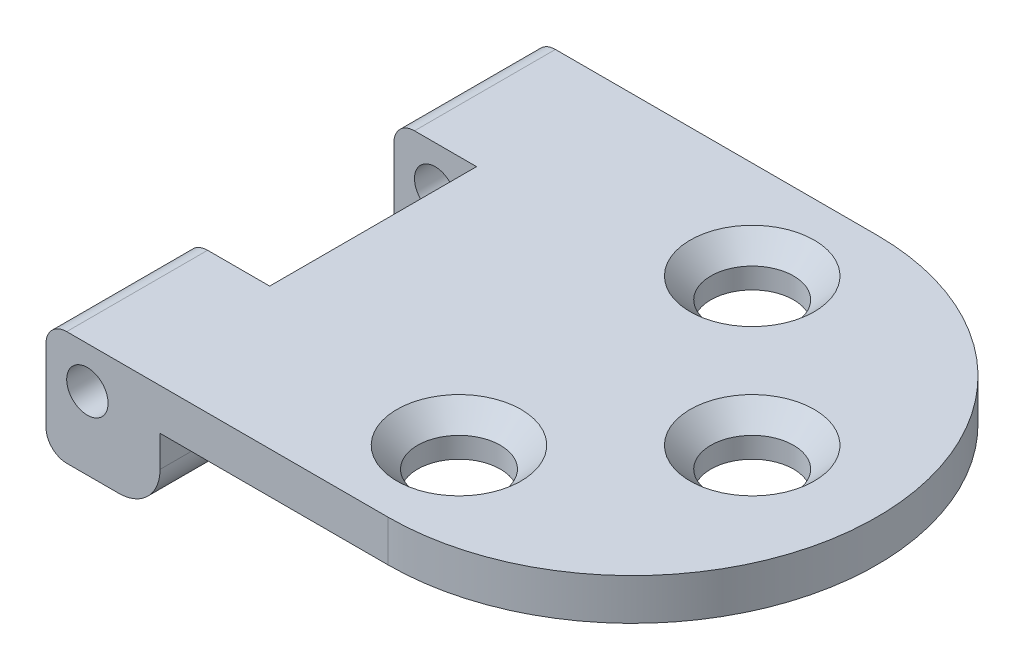
ISO-10303-21;
HEADER;
FILE_DESCRIPTION(('STEP AP214'),'2;1');
FILE_NAME('part.step','',(''),(''),'','','');
FILE_SCHEMA(('AUTOMOTIVE_DESIGN { 1 0 10303 214 1 1 1 1 }'));
ENDSEC;
DATA;
#1=APPLICATION_CONTEXT('core data for automotive mechanical design processes');
#2=APPLICATION_PROTOCOL_DEFINITION('international standard','automotive_design',2000,#1);
#3=PRODUCT_CONTEXT('',#1,'mechanical');
#4=PRODUCT('Part','Part','',(#3));
#5=PRODUCT_RELATED_PRODUCT_CATEGORY('part','',(#4));
#6=PRODUCT_DEFINITION_FORMATION('','',#4);
#7=PRODUCT_DEFINITION_CONTEXT('part definition',#1,'design');
#8=PRODUCT_DEFINITION('design','',#6,#7);
#9=PRODUCT_DEFINITION_SHAPE('','',#8);
#10=(LENGTH_UNIT() NAMED_UNIT(*) SI_UNIT(.MILLI.,.METRE.));
#11=(NAMED_UNIT(*) PLANE_ANGLE_UNIT() SI_UNIT($,.RADIAN.));
#12=(NAMED_UNIT(*) SI_UNIT($,.STERADIAN.) SOLID_ANGLE_UNIT());
#13=UNCERTAINTY_MEASURE_WITH_UNIT(LENGTH_MEASURE(1.E-05),#10,'distance_accuracy_value','');
#14=(GEOMETRIC_REPRESENTATION_CONTEXT(3) GLOBAL_UNCERTAINTY_ASSIGNED_CONTEXT((#13)) GLOBAL_UNIT_ASSIGNED_CONTEXT((#10,
#11,#12)) REPRESENTATION_CONTEXT('',''));
#15=CARTESIAN_POINT('',(0.,0.,0.));
#16=DIRECTION('',(0.,0.,1.));
#17=DIRECTION('',(1.,0.,0.));
#18=AXIS2_PLACEMENT_3D('',#15,#16,#17);
#19=CARTESIAN_POINT('',(0.,7.,0.));
#20=DIRECTION('',(1.,0.,0.));
#21=DIRECTION('',(0.,0.,-1.));
#22=AXIS2_PLACEMENT_3D('',#19,#20,#21);
#23=PLANE('',#22);
#24=DIRECTION('',(0.,0.,1.));
#25=VECTOR('',#24,1.);
#26=CARTESIAN_POINT('',(0.,1.27,0.));
#27=LINE('',#26,#25);
#28=CARTESIAN_POINT('',(0.,1.27,-30.));
#29=VERTEX_POINT('',#28);
#30=CARTESIAN_POINT('',(0.,1.27,-21.35));
#31=VERTEX_POINT('',#30);
#32=EDGE_CURVE('E169',#29,#31,#27,.T.);
#33=ORIENTED_EDGE('',*,*,#32,.T.);
#34=DIRECTION('',(0.,1.,0.));
#35=VECTOR('',#34,1.);
#36=CARTESIAN_POINT('',(0.,-0.00100000000000013,-21.35));
#37=LINE('',#36,#35);
#38=CARTESIAN_POINT('',(0.,5.73,-21.35));
#39=VERTEX_POINT('',#38);
#40=EDGE_CURVE('E153',#31,#39,#37,.T.);
#41=ORIENTED_EDGE('',*,*,#40,.T.);
#42=DIRECTION('',(0.,0.,1.));
#43=VECTOR('',#42,1.);
#44=CARTESIAN_POINT('',(0.,5.73,0.));
#45=LINE('',#44,#43);
#46=CARTESIAN_POINT('',(0.,5.73,-30.));
#47=VERTEX_POINT('',#46);
#48=EDGE_CURVE('E167',#39,#47,#45,.F.);
#49=ORIENTED_EDGE('',*,*,#48,.T.);
#50=DIRECTION('',(0.,-1.,0.));
#51=VECTOR('',#50,1.);
#52=CARTESIAN_POINT('',(0.,7.,-30.));
#53=LINE('',#52,#51);
#54=EDGE_CURVE('E333',#47,#29,#53,.T.);
#55=ORIENTED_EDGE('',*,*,#54,.T.);
#56=EDGE_LOOP('',(#33,#41,#49,#55));
#57=FACE_BOUND('',#56,.T.);
#58=ADVANCED_FACE('F35',(#57),#23,.F.);
#59=CARTESIAN_POINT('',(21.000000028,0.,-15.));
#60=DIRECTION('',(0.,-1.,0.));
#61=DIRECTION('',(0.,0.,-1.));
#62=AXIS2_PLACEMENT_3D('',#59,#60,#61);
#63=PLANE('',#62);
#64=DIRECTION('',(-1.,0.,0.));
#65=VECTOR('',#64,1.);
#66=CARTESIAN_POINT('',(0.,0.,-21.35));
#67=LINE('',#66,#65);
#68=CARTESIAN_POINT('',(4.46,0.,-21.35));
#69=VERTEX_POINT('',#68);
#70=CARTESIAN_POINT('',(1.27,0.,-21.35));
#71=VERTEX_POINT('',#70);
#72=EDGE_CURVE('E283',#69,#71,#67,.T.);
#73=ORIENTED_EDGE('',*,*,#72,.T.);
#74=DIRECTION('',(0.,0.,1.));
#75=VECTOR('',#74,1.);
#76=CARTESIAN_POINT('',(1.27,0.,-30.));
#77=LINE('',#76,#75);
#78=CARTESIAN_POINT('',(1.27,0.,-30.));
#79=VERTEX_POINT('',#78);
#80=EDGE_CURVE('E188',#71,#79,#77,.F.);
#81=ORIENTED_EDGE('',*,*,#80,.T.);
#82=DIRECTION('',(-1.,0.,0.));
#83=VECTOR('',#82,1.);
#84=CARTESIAN_POINT('',(0.,0.,-30.));
#85=LINE('',#84,#83);
#86=CARTESIAN_POINT('',(4.46,0.,-30.));
#87=VERTEX_POINT('',#86);
#88=EDGE_CURVE('E329',#87,#79,#85,.T.);
#89=ORIENTED_EDGE('',*,*,#88,.F.);
#90=DIRECTION('',(0.,0.,-1.));
#91=VECTOR('',#90,1.);
#92=CARTESIAN_POINT('',(4.46,0.,0.));
#93=LINE('',#92,#91);
#94=EDGE_CURVE('E179',#87,#69,#93,.F.);
#95=ORIENTED_EDGE('',*,*,#94,.T.);
#96=EDGE_LOOP('',(#73,#81,#89,#95));
#97=FACE_BOUND('',#96,.T.);
#98=ADVANCED_FACE('F230',(#97),#63,.T.);
#99=CARTESIAN_POINT('',(1.27,1.27,0.));
#100=DIRECTION('',(0.,0.,-1.));
#101=DIRECTION('',(-1.,0.,0.));
#102=AXIS2_PLACEMENT_3D('',#99,#100,#101);
#103=CYLINDRICAL_SURFACE('',#102,1.27);
#104=CARTESIAN_POINT('',(1.27,1.27,-21.35));
#105=DIRECTION('',(0.,0.,-1.));
#106=DIRECTION('',(-1.,0.,0.));
#107=AXIS2_PLACEMENT_3D('',#104,#105,#106);
#108=CIRCLE('',#107,1.27);
#109=EDGE_CURVE('E161',#71,#31,#108,.T.);
#110=ORIENTED_EDGE('',*,*,#109,.T.);
#111=ORIENTED_EDGE('',*,*,#32,.F.);
#112=CARTESIAN_POINT('',(1.27,1.27,-30.));
#113=DIRECTION('',(0.,0.,1.));
#114=DIRECTION('',(1.,0.,0.));
#115=AXIS2_PLACEMENT_3D('',#112,#113,#114);
#116=CIRCLE('',#115,1.27);
#117=EDGE_CURVE('E193',#79,#29,#116,.F.);
#118=ORIENTED_EDGE('',*,*,#117,.F.);
#119=ORIENTED_EDGE('',*,*,#80,.F.);
#120=EDGE_LOOP('',(#110,#111,#118,#119));
#121=FACE_BOUND('',#120,.T.);
#122=ADVANCED_FACE('F236',(#121),#103,.T.);
#123=CARTESIAN_POINT('',(1.27,5.73,-15.));
#124=DIRECTION('',(0.,0.,1.));
#125=DIRECTION('',(1.,0.,0.));
#126=AXIS2_PLACEMENT_3D('',#123,#124,#125);
#127=CYLINDRICAL_SURFACE('',#126,1.27);
#128=CARTESIAN_POINT('',(1.27,5.73,-21.35));
#129=DIRECTION('',(0.,0.,-1.));
#130=DIRECTION('',(-1.,0.,0.));
#131=AXIS2_PLACEMENT_3D('',#128,#129,#130);
#132=CIRCLE('',#131,1.27);
#133=CARTESIAN_POINT('',(1.27,7.,-21.35));
#134=VERTEX_POINT('',#133);
#135=EDGE_CURVE('E150',#39,#134,#132,.T.);
#136=ORIENTED_EDGE('',*,*,#135,.T.);
#137=DIRECTION('',(0.,0.,1.));
#138=VECTOR('',#137,1.);
#139=CARTESIAN_POINT('',(1.27,7.,-15.));
#140=LINE('',#139,#138);
#141=CARTESIAN_POINT('',(1.27,7.,-30.));
#142=VERTEX_POINT('',#141);
#143=EDGE_CURVE('E196',#142,#134,#140,.T.);
#144=ORIENTED_EDGE('',*,*,#143,.F.);
#145=CARTESIAN_POINT('',(1.27,5.73,-30.));
#146=DIRECTION('',(0.,0.,1.));
#147=DIRECTION('',(1.,0.,0.));
#148=AXIS2_PLACEMENT_3D('',#145,#146,#147);
#149=CIRCLE('',#148,1.27);
#150=EDGE_CURVE('E59',#47,#142,#149,.F.);
#151=ORIENTED_EDGE('',*,*,#150,.F.);
#152=ORIENTED_EDGE('',*,*,#48,.F.);
#153=EDGE_LOOP('',(#136,#144,#151,#152));
#154=FACE_BOUND('',#153,.T.);
#155=ADVANCED_FACE('F173',(#154),#127,.T.);
#156=CARTESIAN_POINT('',(21.000000028,7.,-15.));
#157=DIRECTION('',(0.,-1.,0.));
#158=DIRECTION('',(0.,0.,-1.));
#159=AXIS2_PLACEMENT_3D('',#156,#157,#158);
#160=CYLINDRICAL_SURFACE('',#159,15.);
#161=CARTESIAN_POINT('',(21.000000028,4.46,-15.));
#162=DIRECTION('',(0.,-1.,0.));
#163=DIRECTION('',(0.,0.,-1.));
#164=AXIS2_PLACEMENT_3D('',#161,#162,#163);
#165=CIRCLE('',#164,15.);
#166=CARTESIAN_POINT('',(21.000000028,4.46,-30.));
#167=VERTEX_POINT('',#166);
#168=CARTESIAN_POINT('',(21.000000028,4.46,0.));
#169=VERTEX_POINT('',#168);
#170=EDGE_CURVE('E323',#167,#169,#165,.T.);
#171=ORIENTED_EDGE('',*,*,#170,.F.);
#172=DIRECTION('',(0.,-1.,0.));
#173=VECTOR('',#172,1.);
#174=CARTESIAN_POINT('',(21.000000028,7.,-30.));
#175=LINE('',#174,#173);
#176=CARTESIAN_POINT('',(21.000000028,7.,-30.));
#177=VERTEX_POINT('',#176);
#178=EDGE_CURVE('E339',#177,#167,#175,.T.);
#179=ORIENTED_EDGE('',*,*,#178,.F.);
#180=CARTESIAN_POINT('',(21.000000028,7.,-15.));
#181=DIRECTION('',(0.,1.,0.));
#182=DIRECTION('',(0.,0.,-1.));
#183=AXIS2_PLACEMENT_3D('',#180,#181,#182);
#184=CIRCLE('',#183,15.);
#185=CARTESIAN_POINT('',(21.000000028,7.,0.));
#186=VERTEX_POINT('',#185);
#187=EDGE_CURVE('E328',#186,#177,#184,.T.);
#188=ORIENTED_EDGE('',*,*,#187,.F.);
#189=DIRECTION('',(0.,-1.,0.));
#190=VECTOR('',#189,1.);
#191=CARTESIAN_POINT('',(21.000000028,7.,0.));
#192=LINE('',#191,#190);
#193=EDGE_CURVE('E342',#186,#169,#192,.T.);
#194=ORIENTED_EDGE('',*,*,#193,.T.);
#195=EDGE_LOOP('',(#171,#179,#188,#194));
#196=FACE_BOUND('',#195,.T.);
#197=ADVANCED_FACE('F244',(#196),#160,.T.);
#198=CARTESIAN_POINT('',(0.,5.73,0.));
#199=VERTEX_POINT('',#198);
#200=CARTESIAN_POINT('',(0.,5.73,-8.65));
#201=VERTEX_POINT('',#200);
#202=EDGE_CURVE('E174',#199,#201,#45,.F.);
#203=ORIENTED_EDGE('',*,*,#202,.T.);
#204=DIRECTION('',(0.,1.,0.));
#205=VECTOR('',#204,1.);
#206=CARTESIAN_POINT('',(0.,-0.00100000000000013,-8.65));
#207=LINE('',#206,#205);
#208=CARTESIAN_POINT('',(0.,1.27,-8.65));
#209=VERTEX_POINT('',#208);
#210=EDGE_CURVE('E51',#209,#201,#207,.T.);
#211=ORIENTED_EDGE('',*,*,#210,.F.);
#212=CARTESIAN_POINT('',(0.,1.27,0.));
#213=VERTEX_POINT('',#212);
#214=EDGE_CURVE('E178',#209,#213,#27,.T.);
#215=ORIENTED_EDGE('',*,*,#214,.T.);
#216=DIRECTION('',(0.,-1.,0.));
#217=VECTOR('',#216,1.);
#218=CARTESIAN_POINT('',(0.,7.,0.));
#219=LINE('',#218,#217);
#220=EDGE_CURVE('E259',#199,#213,#219,.T.);
#221=ORIENTED_EDGE('',*,*,#220,.F.);
#222=EDGE_LOOP('',(#203,#211,#215,#221));
#223=FACE_BOUND('',#222,.T.);
#224=ADVANCED_FACE('F232',(#223),#23,.F.);
#225=CARTESIAN_POINT('',(0.,7.,0.));
#226=DIRECTION('',(0.,0.,-1.));
#227=DIRECTION('',(-1.,0.,0.));
#228=AXIS2_PLACEMENT_3D('',#225,#226,#227);
#229=PLANE('',#228);
#230=CARTESIAN_POINT('',(2.54,4.46,0.));
#231=DIRECTION('',(0.,0.,1.));
#232=DIRECTION('',(1.,0.,0.));
#233=AXIS2_PLACEMENT_3D('',#230,#231,#232);
#234=CIRCLE('',#233,1.27);
#235=CARTESIAN_POINT('',(3.81,4.46,0.));
#236=VERTEX_POINT('',#235);
#237=EDGE_CURVE('E423',#236,#236,#234,.T.);
#238=ORIENTED_EDGE('',*,*,#237,.F.);
#239=EDGE_LOOP('',(#238));
#240=FACE_BOUND('',#239,.T.);
#241=ORIENTED_EDGE('',*,*,#220,.T.);
#242=CARTESIAN_POINT('',(1.27,1.27,0.));
#243=DIRECTION('',(0.,0.,-1.));
#244=DIRECTION('',(-1.,0.,0.));
#245=AXIS2_PLACEMENT_3D('',#242,#243,#244);
#246=CIRCLE('',#245,1.27);
#247=CARTESIAN_POINT('',(1.27,0.,0.));
#248=VERTEX_POINT('',#247);
#249=EDGE_CURVE('E186',#213,#248,#246,.F.);
#250=ORIENTED_EDGE('',*,*,#249,.T.);
#251=DIRECTION('',(1.,0.,0.));
#252=VECTOR('',#251,1.);
#253=CARTESIAN_POINT('',(0.,0.,0.));
#254=LINE('',#253,#252);
#255=CARTESIAN_POINT('',(4.46,0.,0.));
#256=VERTEX_POINT('',#255);
#257=EDGE_CURVE('E325',#248,#256,#254,.T.);
#258=ORIENTED_EDGE('',*,*,#257,.T.);
#259=CARTESIAN_POINT('',(4.46,2.54,0.));
#260=DIRECTION('',(0.,0.,-1.));
#261=DIRECTION('',(-1.,0.,0.));
#262=AXIS2_PLACEMENT_3D('',#259,#260,#261);
#263=CIRCLE('',#262,2.54);
#264=CARTESIAN_POINT('',(7.,2.54,0.));
#265=VERTEX_POINT('',#264);
#266=EDGE_CURVE('E175',#256,#265,#263,.F.);
#267=ORIENTED_EDGE('',*,*,#266,.T.);
#268=DIRECTION('',(0.,-1.,0.));
#269=VECTOR('',#268,1.);
#270=CARTESIAN_POINT('',(7.,48.8757583149545,0.));
#271=LINE('',#270,#269);
#272=CARTESIAN_POINT('',(7.,4.46,0.));
#273=VERTEX_POINT('',#272);
#274=EDGE_CURVE('E313',#273,#265,#271,.T.);
#275=ORIENTED_EDGE('',*,*,#274,.F.);
#276=DIRECTION('',(-1.,0.,0.));
#277=VECTOR('',#276,1.);
#278=CARTESIAN_POINT('',(7.,4.46,0.));
#279=LINE('',#278,#277);
#280=EDGE_CURVE('E310',#169,#273,#279,.T.);
#281=ORIENTED_EDGE('',*,*,#280,.F.);
#282=ORIENTED_EDGE('',*,*,#193,.F.);
#283=DIRECTION('',(1.,0.,0.));
#284=VECTOR('',#283,1.);
#285=CARTESIAN_POINT('',(0.,7.,0.));
#286=LINE('',#285,#284);
#287=CARTESIAN_POINT('',(1.27,7.,0.));
#288=VERTEX_POINT('',#287);
#289=EDGE_CURVE('E326',#288,#186,#286,.T.);
#290=ORIENTED_EDGE('',*,*,#289,.F.);
#291=CARTESIAN_POINT('',(1.27,5.73,0.));
#292=DIRECTION('',(0.,0.,-1.));
#293=DIRECTION('',(-1.,0.,0.));
#294=AXIS2_PLACEMENT_3D('',#291,#292,#293);
#295=CIRCLE('',#294,1.27);
#296=EDGE_CURVE('E184',#288,#199,#295,.F.);
#297=ORIENTED_EDGE('',*,*,#296,.T.);
#298=EDGE_LOOP('',(#241,#250,#258,#267,#275,#281,#282,#290,#297));
#299=FACE_BOUND('',#298,.T.);
#300=ADVANCED_FACE('F243',(#240,#299),#229,.F.);
#301=CARTESIAN_POINT('',(0.,7.,-30.));
#302=DIRECTION('',(0.,0.,1.));
#303=DIRECTION('',(1.,0.,0.));
#304=AXIS2_PLACEMENT_3D('',#301,#302,#303);
#305=PLANE('',#304);
#306=CARTESIAN_POINT('',(2.54,4.46,-30.));
#307=DIRECTION('',(0.,0.,1.));
#308=DIRECTION('',(1.,0.,0.));
#309=AXIS2_PLACEMENT_3D('',#306,#307,#308);
#310=CIRCLE('',#309,1.27);
#311=CARTESIAN_POINT('',(3.81,4.46,-30.));
#312=VERTEX_POINT('',#311);
#313=EDGE_CURVE('E421',#312,#312,#310,.T.);
#314=ORIENTED_EDGE('',*,*,#313,.T.);
#315=EDGE_LOOP('',(#314));
#316=FACE_BOUND('',#315,.T.);
#317=ORIENTED_EDGE('',*,*,#88,.T.);
#318=ORIENTED_EDGE('',*,*,#117,.T.);
#319=ORIENTED_EDGE('',*,*,#54,.F.);
#320=ORIENTED_EDGE('',*,*,#150,.T.);
#321=DIRECTION('',(-1.,0.,0.));
#322=VECTOR('',#321,1.);
#323=CARTESIAN_POINT('',(0.,7.,-30.));
#324=LINE('',#323,#322);
#325=EDGE_CURVE('E331',#177,#142,#324,.T.);
#326=ORIENTED_EDGE('',*,*,#325,.F.);
#327=ORIENTED_EDGE('',*,*,#178,.T.);
#328=DIRECTION('',(-1.,0.,0.));
#329=VECTOR('',#328,1.);
#330=CARTESIAN_POINT('',(7.,4.46,-30.));
#331=LINE('',#330,#329);
#332=CARTESIAN_POINT('',(7.,4.46,-30.));
#333=VERTEX_POINT('',#332);
#334=EDGE_CURVE('E316',#167,#333,#331,.T.);
#335=ORIENTED_EDGE('',*,*,#334,.T.);
#336=DIRECTION('',(0.,-1.,0.));
#337=VECTOR('',#336,1.);
#338=CARTESIAN_POINT('',(7.,48.8757583149545,-30.));
#339=LINE('',#338,#337);
#340=CARTESIAN_POINT('',(7.,2.54,-30.));
#341=VERTEX_POINT('',#340);
#342=EDGE_CURVE('E303',#333,#341,#339,.T.);
#343=ORIENTED_EDGE('',*,*,#342,.T.);
#344=CARTESIAN_POINT('',(4.46,2.54,-30.));
#345=DIRECTION('',(0.,0.,1.));
#346=DIRECTION('',(1.,0.,0.));
#347=AXIS2_PLACEMENT_3D('',#344,#345,#346);
#348=CIRCLE('',#347,2.54);
#349=EDGE_CURVE('E349',#341,#87,#348,.F.);
#350=ORIENTED_EDGE('',*,*,#349,.T.);
#351=EDGE_LOOP('',(#317,#318,#319,#320,#326,#327,#335,#343,#350));
#352=FACE_BOUND('',#351,.T.);
#353=ADVANCED_FACE('F251',(#316,#352),#305,.F.);
#354=CARTESIAN_POINT('',(21.000000028,7.,-15.));
#355=DIRECTION('',(0.,-1.,0.));
#356=DIRECTION('',(0.,0.,-1.));
#357=AXIS2_PLACEMENT_3D('',#354,#355,#356);
#358=PLANE('',#357);
#359=CARTESIAN_POINT('',(19.3499994,7.,-6.00000022000001));
#360=DIRECTION('',(0.,-1.,0.));
#361=DIRECTION('',(0.,0.,-1.));
#362=AXIS2_PLACEMENT_3D('',#359,#360,#361);
#363=CIRCLE('',#362,3.81000000000001);
#364=CARTESIAN_POINT('',(19.3499994,7.,-9.81000022000002));
#365=VERTEX_POINT('',#364);
#366=EDGE_CURVE('E207',#365,#365,#363,.T.);
#367=ORIENTED_EDGE('',*,*,#366,.T.);
#368=EDGE_LOOP('',(#367));
#369=FACE_BOUND('',#368,.T.);
#370=CARTESIAN_POINT('',(28.34999918,7.,-15.));
#371=DIRECTION('',(0.,-1.,0.));
#372=DIRECTION('',(0.,0.,-1.));
#373=AXIS2_PLACEMENT_3D('',#370,#371,#372);
#374=CIRCLE('',#373,3.81000000000001);
#375=CARTESIAN_POINT('',(28.34999918,7.,-18.81));
#376=VERTEX_POINT('',#375);
#377=EDGE_CURVE('E204',#376,#376,#374,.T.);
#378=ORIENTED_EDGE('',*,*,#377,.T.);
#379=EDGE_LOOP('',(#378));
#380=FACE_BOUND('',#379,.T.);
#381=CARTESIAN_POINT('',(19.3499994,7.,-23.99999978));
#382=DIRECTION('',(0.,-1.,0.));
#383=DIRECTION('',(0.,0.,-1.));
#384=AXIS2_PLACEMENT_3D('',#381,#382,#383);
#385=CIRCLE('',#384,3.81);
#386=CARTESIAN_POINT('',(19.3499994,7.,-27.80999978));
#387=VERTEX_POINT('',#386);
#388=EDGE_CURVE('E201',#387,#387,#385,.T.);
#389=ORIENTED_EDGE('',*,*,#388,.T.);
#390=EDGE_LOOP('',(#389));
#391=FACE_BOUND('',#390,.T.);
#392=ORIENTED_EDGE('',*,*,#143,.T.);
#393=DIRECTION('',(-1.,0.,0.));
#394=VECTOR('',#393,1.);
#395=CARTESIAN_POINT('',(0.,7.,-21.35));
#396=LINE('',#395,#394);
#397=CARTESIAN_POINT('',(5.08,7.,-21.35));
#398=VERTEX_POINT('',#397);
#399=EDGE_CURVE('E156',#398,#134,#396,.T.);
#400=ORIENTED_EDGE('',*,*,#399,.F.);
#401=DIRECTION('',(0.,0.,-1.));
#402=VECTOR('',#401,1.);
#403=CARTESIAN_POINT('',(5.08,7.,-21.35));
#404=LINE('',#403,#402);
#405=CARTESIAN_POINT('',(5.08,7.,-8.65));
#406=VERTEX_POINT('',#405);
#407=EDGE_CURVE('E288',#406,#398,#404,.T.);
#408=ORIENTED_EDGE('',*,*,#407,.F.);
#409=DIRECTION('',(1.,0.,0.));
#410=VECTOR('',#409,1.);
#411=CARTESIAN_POINT('',(0.,7.,-8.65));
#412=LINE('',#411,#410);
#413=CARTESIAN_POINT('',(1.27,7.,-8.65));
#414=VERTEX_POINT('',#413);
#415=EDGE_CURVE('E286',#414,#406,#412,.T.);
#416=ORIENTED_EDGE('',*,*,#415,.F.);
#417=EDGE_CURVE('E195',#414,#288,#140,.T.);
#418=ORIENTED_EDGE('',*,*,#417,.T.);
#419=ORIENTED_EDGE('',*,*,#289,.T.);
#420=ORIENTED_EDGE('',*,*,#187,.T.);
#421=ORIENTED_EDGE('',*,*,#325,.T.);
#422=EDGE_LOOP('',(#392,#400,#408,#416,#418,#419,#420,#421));
#423=FACE_BOUND('',#422,.T.);
#424=ADVANCED_FACE('F376',(#369,#380,#391,#423),#358,.F.);
#425=DIRECTION('',(1.,0.,0.));
#426=VECTOR('',#425,1.);
#427=CARTESIAN_POINT('',(0.,0.,-8.65));
#428=LINE('',#427,#426);
#429=CARTESIAN_POINT('',(1.27,0.,-8.65));
#430=VERTEX_POINT('',#429);
#431=CARTESIAN_POINT('',(4.46,0.,-8.65));
#432=VERTEX_POINT('',#431);
#433=EDGE_CURVE('E298',#430,#432,#428,.T.);
#434=ORIENTED_EDGE('',*,*,#433,.T.);
#435=EDGE_CURVE('E350',#432,#256,#93,.F.);
#436=ORIENTED_EDGE('',*,*,#435,.T.);
#437=ORIENTED_EDGE('',*,*,#257,.F.);
#438=EDGE_CURVE('E189',#248,#430,#77,.F.);
#439=ORIENTED_EDGE('',*,*,#438,.T.);
#440=EDGE_LOOP('',(#434,#436,#437,#439));
#441=FACE_BOUND('',#440,.T.);
#442=ADVANCED_FACE('F239',(#441),#63,.T.);
#443=CARTESIAN_POINT('',(21.000000028,4.46,-15.));
#444=DIRECTION('',(0.,-1.,0.));
#445=DIRECTION('',(0.,0.,-1.));
#446=AXIS2_PLACEMENT_3D('',#443,#444,#445);
#447=PLANE('',#446);
#448=CARTESIAN_POINT('',(28.34999918,4.46,-15.));
#449=DIRECTION('',(0.,-1.,0.));
#450=DIRECTION('',(0.,0.,-1.));
#451=AXIS2_PLACEMENT_3D('',#448,#449,#450);
#452=CIRCLE('',#451,2.54000000000001);
#453=CARTESIAN_POINT('',(28.34999918,4.46,-17.54));
#454=VERTEX_POINT('',#453);
#455=EDGE_CURVE('E267',#454,#454,#452,.F.);
#456=ORIENTED_EDGE('',*,*,#455,.T.);
#457=EDGE_LOOP('',(#456));
#458=FACE_BOUND('',#457,.T.);
#459=CARTESIAN_POINT('',(19.3499994,4.46,-23.99999978));
#460=DIRECTION('',(0.,-1.,0.));
#461=DIRECTION('',(0.,0.,-1.));
#462=AXIS2_PLACEMENT_3D('',#459,#460,#461);
#463=CIRCLE('',#462,2.54);
#464=CARTESIAN_POINT('',(19.3499994,4.46,-26.53999978));
#465=VERTEX_POINT('',#464);
#466=EDGE_CURVE('E270',#465,#465,#463,.F.);
#467=ORIENTED_EDGE('',*,*,#466,.T.);
#468=EDGE_LOOP('',(#467));
#469=FACE_BOUND('',#468,.T.);
#470=CARTESIAN_POINT('',(19.3499994,4.46,-6.00000022000001));
#471=DIRECTION('',(0.,-1.,0.));
#472=DIRECTION('',(0.,0.,-1.));
#473=AXIS2_PLACEMENT_3D('',#470,#471,#472);
#474=CIRCLE('',#473,2.54000000000001);
#475=CARTESIAN_POINT('',(19.3499994,4.46,-8.54000022000002));
#476=VERTEX_POINT('',#475);
#477=EDGE_CURVE('E307',#476,#476,#474,.F.);
#478=ORIENTED_EDGE('',*,*,#477,.T.);
#479=EDGE_LOOP('',(#478));
#480=FACE_BOUND('',#479,.T.);
#481=ORIENTED_EDGE('',*,*,#170,.T.);
#482=ORIENTED_EDGE('',*,*,#280,.T.);
#483=DIRECTION('',(0.,0.,1.));
#484=VECTOR('',#483,1.);
#485=CARTESIAN_POINT('',(7.,4.46,0.));
#486=LINE('',#485,#484);
#487=EDGE_CURVE('E312',#333,#273,#486,.T.);
#488=ORIENTED_EDGE('',*,*,#487,.F.);
#489=ORIENTED_EDGE('',*,*,#334,.F.);
#490=EDGE_LOOP('',(#481,#482,#488,#489));
#491=FACE_BOUND('',#490,.T.);
#492=ADVANCED_FACE('F371',(#458,#469,#480,#491),#447,.T.);
#493=CARTESIAN_POINT('',(7.,48.8757583149545,0.));
#494=DIRECTION('',(-1.,0.,0.));
#495=DIRECTION('',(0.,0.,1.));
#496=AXIS2_PLACEMENT_3D('',#493,#494,#495);
#497=PLANE('',#496);
#498=ORIENTED_EDGE('',*,*,#274,.T.);
#499=DIRECTION('',(0.,0.,-1.));
#500=VECTOR('',#499,1.);
#501=CARTESIAN_POINT('',(7.,2.54,-30.));
#502=LINE('',#501,#500);
#503=EDGE_CURVE('E346',#265,#341,#502,.T.);
#504=ORIENTED_EDGE('',*,*,#503,.T.);
#505=ORIENTED_EDGE('',*,*,#342,.F.);
#506=ORIENTED_EDGE('',*,*,#487,.T.);
#507=EDGE_LOOP('',(#498,#504,#505,#506));
#508=FACE_BOUND('',#507,.T.);
#509=ADVANCED_FACE('F367',(#508),#497,.F.);
#510=CARTESIAN_POINT('',(4.46,2.54,0.));
#511=DIRECTION('',(0.,0.,1.));
#512=DIRECTION('',(1.,0.,0.));
#513=AXIS2_PLACEMENT_3D('',#510,#511,#512);
#514=CYLINDRICAL_SURFACE('',#513,2.54);
#515=CARTESIAN_POINT('',(4.46,2.54,-21.35));
#516=DIRECTION('',(0.,0.,-1.));
#517=DIRECTION('',(-1.,0.,0.));
#518=AXIS2_PLACEMENT_3D('',#515,#516,#517);
#519=CIRCLE('',#518,2.54);
#520=CARTESIAN_POINT('',(5.08000000000001,0.0768313090654966,-21.35));
#521=VERTEX_POINT('',#520);
#522=EDGE_CURVE('E280',#521,#69,#519,.T.);
#523=ORIENTED_EDGE('',*,*,#522,.T.);
#524=ORIENTED_EDGE('',*,*,#94,.F.);
#525=ORIENTED_EDGE('',*,*,#349,.F.);
#526=ORIENTED_EDGE('',*,*,#503,.F.);
#527=ORIENTED_EDGE('',*,*,#266,.F.);
#528=ORIENTED_EDGE('',*,*,#435,.F.);
#529=CARTESIAN_POINT('',(4.46,2.54,-8.65));
#530=DIRECTION('',(0.,0.,1.));
#531=DIRECTION('',(1.,0.,0.));
#532=AXIS2_PLACEMENT_3D('',#529,#530,#531);
#533=CIRCLE('',#532,2.54);
#534=CARTESIAN_POINT('',(5.08,0.0768313090654962,-8.65));
#535=VERTEX_POINT('',#534);
#536=EDGE_CURVE('E301',#432,#535,#533,.T.);
#537=ORIENTED_EDGE('',*,*,#536,.T.);
#538=DIRECTION('',(0.,0.,1.));
#539=VECTOR('',#538,1.);
#540=CARTESIAN_POINT('',(5.08,0.0768313090654966,0.));
#541=LINE('',#540,#539);
#542=EDGE_CURVE('E277',#535,#521,#541,.F.);
#543=ORIENTED_EDGE('',*,*,#542,.T.);
#544=EDGE_LOOP('',(#523,#524,#525,#526,#527,#528,#537,#543));
#545=FACE_BOUND('',#544,.T.);
#546=ADVANCED_FACE('F364',(#545),#514,.T.);
#547=CARTESIAN_POINT('',(1.27,1.27,-8.65));
#548=DIRECTION('',(0.,0.,1.));
#549=DIRECTION('',(1.,0.,0.));
#550=AXIS2_PLACEMENT_3D('',#547,#548,#549);
#551=CIRCLE('',#550,1.27);
#552=EDGE_CURVE('E170',#209,#430,#551,.T.);
#553=ORIENTED_EDGE('',*,*,#552,.T.);
#554=ORIENTED_EDGE('',*,*,#438,.F.);
#555=ORIENTED_EDGE('',*,*,#249,.F.);
#556=ORIENTED_EDGE('',*,*,#214,.F.);
#557=EDGE_LOOP('',(#553,#554,#555,#556));
#558=FACE_BOUND('',#557,.T.);
#559=ADVANCED_FACE('F388',(#558),#103,.T.);
#560=CARTESIAN_POINT('',(1.27,5.73,-8.65));
#561=DIRECTION('',(0.,0.,1.));
#562=DIRECTION('',(1.,0.,0.));
#563=AXIS2_PLACEMENT_3D('',#560,#561,#562);
#564=CIRCLE('',#563,1.27);
#565=EDGE_CURVE('E162',#414,#201,#564,.T.);
#566=ORIENTED_EDGE('',*,*,#565,.T.);
#567=ORIENTED_EDGE('',*,*,#202,.F.);
#568=ORIENTED_EDGE('',*,*,#296,.F.);
#569=ORIENTED_EDGE('',*,*,#417,.F.);
#570=EDGE_LOOP('',(#566,#567,#568,#569));
#571=FACE_BOUND('',#570,.T.);
#572=ADVANCED_FACE('F262',(#571),#127,.T.);
#573=CARTESIAN_POINT('',(0.,-0.00100000000000013,-21.35));
#574=DIRECTION('',(0.,0.,-1.));
#575=DIRECTION('',(-1.,0.,0.));
#576=AXIS2_PLACEMENT_3D('',#573,#574,#575);
#577=PLANE('',#576);
#578=CARTESIAN_POINT('',(2.54,4.46,-21.35));
#579=DIRECTION('',(0.,0.,-1.));
#580=DIRECTION('',(-1.,0.,0.));
#581=AXIS2_PLACEMENT_3D('',#578,#579,#580);
#582=CIRCLE('',#581,1.27);
#583=CARTESIAN_POINT('',(1.27,4.46,-21.35));
#584=VERTEX_POINT('',#583);
#585=EDGE_CURVE('E273',#584,#584,#582,.T.);
#586=ORIENTED_EDGE('',*,*,#585,.T.);
#587=EDGE_LOOP('',(#586));
#588=FACE_BOUND('',#587,.T.);
#589=DIRECTION('',(0.,1.,0.));
#590=VECTOR('',#589,1.);
#591=CARTESIAN_POINT('',(5.08,-0.00100000000000013,-21.35));
#592=LINE('',#591,#590);
#593=EDGE_CURVE('E171',#521,#398,#592,.T.);
#594=ORIENTED_EDGE('',*,*,#593,.T.);
#595=ORIENTED_EDGE('',*,*,#399,.T.);
#596=ORIENTED_EDGE('',*,*,#135,.F.);
#597=ORIENTED_EDGE('',*,*,#40,.F.);
#598=ORIENTED_EDGE('',*,*,#109,.F.);
#599=ORIENTED_EDGE('',*,*,#72,.F.);
#600=ORIENTED_EDGE('',*,*,#522,.F.);
#601=EDGE_LOOP('',(#594,#595,#596,#597,#598,#599,#600));
#602=FACE_BOUND('',#601,.T.);
#603=ADVANCED_FACE('F152',(#588,#602),#577,.F.);
#604=CARTESIAN_POINT('',(0.,-0.00100000000000013,-8.65));
#605=DIRECTION('',(0.,0.,1.));
#606=DIRECTION('',(1.,0.,0.));
#607=AXIS2_PLACEMENT_3D('',#604,#605,#606);
#608=PLANE('',#607);
#609=CARTESIAN_POINT('',(2.54,4.46,-8.65));
#610=DIRECTION('',(0.,0.,1.));
#611=DIRECTION('',(1.,0.,0.));
#612=AXIS2_PLACEMENT_3D('',#609,#610,#611);
#613=CIRCLE('',#612,1.27);
#614=CARTESIAN_POINT('',(3.81,4.46,-8.65));
#615=VERTEX_POINT('',#614);
#616=EDGE_CURVE('E39',#615,#615,#613,.T.);
#617=ORIENTED_EDGE('',*,*,#616,.T.);
#618=EDGE_LOOP('',(#617));
#619=FACE_BOUND('',#618,.T.);
#620=ORIENTED_EDGE('',*,*,#433,.F.);
#621=ORIENTED_EDGE('',*,*,#552,.F.);
#622=ORIENTED_EDGE('',*,*,#210,.T.);
#623=ORIENTED_EDGE('',*,*,#565,.F.);
#624=ORIENTED_EDGE('',*,*,#415,.T.);
#625=DIRECTION('',(0.,1.,0.));
#626=VECTOR('',#625,1.);
#627=CARTESIAN_POINT('',(5.08,-0.00100000000000013,-8.65));
#628=LINE('',#627,#626);
#629=EDGE_CURVE('E293',#535,#406,#628,.T.);
#630=ORIENTED_EDGE('',*,*,#629,.F.);
#631=ORIENTED_EDGE('',*,*,#536,.F.);
#632=EDGE_LOOP('',(#620,#621,#622,#623,#624,#630,#631));
#633=FACE_BOUND('',#632,.T.);
#634=ADVANCED_FACE('F379',(#619,#633),#608,.F.);
#635=CARTESIAN_POINT('',(5.08,-0.00100000000000013,-21.35));
#636=DIRECTION('',(1.,0.,0.));
#637=DIRECTION('',(0.,0.,-1.));
#638=AXIS2_PLACEMENT_3D('',#635,#636,#637);
#639=PLANE('',#638);
#640=ORIENTED_EDGE('',*,*,#629,.T.);
#641=ORIENTED_EDGE('',*,*,#407,.T.);
#642=ORIENTED_EDGE('',*,*,#593,.F.);
#643=ORIENTED_EDGE('',*,*,#542,.F.);
#644=EDGE_LOOP('',(#640,#641,#642,#643));
#645=FACE_BOUND('',#644,.T.);
#646=ADVANCED_FACE('F382',(#645),#639,.F.);
#647=CARTESIAN_POINT('',(19.3499994,-0.00100000000000013,-6.00000022000001));
#648=DIRECTION('',(0.,1.,0.));
#649=DIRECTION('',(0.,0.,1.));
#650=AXIS2_PLACEMENT_3D('',#647,#648,#649);
#651=CYLINDRICAL_SURFACE('',#650,2.54000000000001);
#652=CARTESIAN_POINT('',(19.3499994,5.73,-6.00000022000001));
#653=DIRECTION('',(0.,-1.,0.));
#654=DIRECTION('',(0.,0.,-1.));
#655=AXIS2_PLACEMENT_3D('',#652,#653,#654);
#656=CIRCLE('',#655,2.54000000000001);
#657=CARTESIAN_POINT('',(19.3499994,5.73,-8.54000022000002));
#658=VERTEX_POINT('',#657);
#659=EDGE_CURVE('E198',#658,#658,#656,.F.);
#660=ORIENTED_EDGE('',*,*,#659,.T.);
#661=EDGE_LOOP('',(#660));
#662=FACE_BOUND('',#661,.T.);
#663=ORIENTED_EDGE('',*,*,#477,.F.);
#664=EDGE_LOOP('',(#663));
#665=FACE_BOUND('',#664,.T.);
#666=ADVANCED_FACE('F441',(#662,#665),#651,.F.);
#667=CARTESIAN_POINT('',(19.3499994,-0.00100000000000013,-23.99999978));
#668=DIRECTION('',(0.,1.,0.));
#669=DIRECTION('',(0.,0.,1.));
#670=AXIS2_PLACEMENT_3D('',#667,#668,#669);
#671=CYLINDRICAL_SURFACE('',#670,2.54);
#672=CARTESIAN_POINT('',(19.3499994,5.73000000000001,-23.99999978));
#673=DIRECTION('',(0.,-1.,0.));
#674=DIRECTION('',(0.,0.,-1.));
#675=AXIS2_PLACEMENT_3D('',#672,#673,#674);
#676=CIRCLE('',#675,2.54);
#677=CARTESIAN_POINT('',(19.3499994,5.73000000000001,-26.53999978));
#678=VERTEX_POINT('',#677);
#679=EDGE_CURVE('E12',#678,#678,#676,.F.);
#680=ORIENTED_EDGE('',*,*,#679,.T.);
#681=EDGE_LOOP('',(#680));
#682=FACE_BOUND('',#681,.T.);
#683=ORIENTED_EDGE('',*,*,#466,.F.);
#684=EDGE_LOOP('',(#683));
#685=FACE_BOUND('',#684,.T.);
#686=ADVANCED_FACE('F448',(#682,#685),#671,.F.);
#687=CARTESIAN_POINT('',(28.34999918,-0.00100000000000013,-15.));
#688=DIRECTION('',(0.,1.,0.));
#689=DIRECTION('',(0.,0.,1.));
#690=AXIS2_PLACEMENT_3D('',#687,#688,#689);
#691=CYLINDRICAL_SURFACE('',#690,2.54000000000001);
#692=CARTESIAN_POINT('',(28.34999918,5.73000000000001,-15.));
#693=DIRECTION('',(0.,-1.,0.));
#694=DIRECTION('',(0.,0.,-1.));
#695=AXIS2_PLACEMENT_3D('',#692,#693,#694);
#696=CIRCLE('',#695,2.54000000000001);
#697=CARTESIAN_POINT('',(28.34999918,5.73000000000001,-17.54));
#698=VERTEX_POINT('',#697);
#699=EDGE_CURVE('E44',#698,#698,#696,.F.);
#700=ORIENTED_EDGE('',*,*,#699,.T.);
#701=EDGE_LOOP('',(#700));
#702=FACE_BOUND('',#701,.T.);
#703=ORIENTED_EDGE('',*,*,#455,.F.);
#704=EDGE_LOOP('',(#703));
#705=FACE_BOUND('',#704,.T.);
#706=ADVANCED_FACE('F213',(#702,#705),#691,.F.);
#707=CARTESIAN_POINT('',(19.3499994,5.73,-6.00000022000001));
#708=DIRECTION('',(0.,1.,0.));
#709=DIRECTION('',(0.,0.,1.));
#710=AXIS2_PLACEMENT_3D('',#707,#708,#709);
#711=CONICAL_SURFACE('',#710,2.54000000000001,0.78539816339745);
#712=ORIENTED_EDGE('',*,*,#366,.F.);
#713=EDGE_LOOP('',(#712));
#714=FACE_BOUND('',#713,.T.);
#715=ORIENTED_EDGE('',*,*,#659,.F.);
#716=EDGE_LOOP('',(#715));
#717=FACE_BOUND('',#716,.T.);
#718=ADVANCED_FACE('F218',(#714,#717),#711,.F.);
#719=CARTESIAN_POINT('',(28.34999918,5.73000000000001,-15.));
#720=DIRECTION('',(0.,1.,0.));
#721=DIRECTION('',(0.,0.,1.));
#722=AXIS2_PLACEMENT_3D('',#719,#720,#721);
#723=CONICAL_SURFACE('',#722,2.54000000000001,0.785398163397453);
#724=ORIENTED_EDGE('',*,*,#377,.F.);
#725=EDGE_LOOP('',(#724));
#726=FACE_BOUND('',#725,.T.);
#727=ORIENTED_EDGE('',*,*,#699,.F.);
#728=EDGE_LOOP('',(#727));
#729=FACE_BOUND('',#728,.T.);
#730=ADVANCED_FACE('F216',(#726,#729),#723,.F.);
#731=CARTESIAN_POINT('',(19.3499994,5.73000000000001,-23.99999978));
#732=DIRECTION('',(0.,1.,0.));
#733=DIRECTION('',(0.,0.,1.));
#734=AXIS2_PLACEMENT_3D('',#731,#732,#733);
#735=CONICAL_SURFACE('',#734,2.54,0.785398163397453);
#736=ORIENTED_EDGE('',*,*,#388,.F.);
#737=EDGE_LOOP('',(#736));
#738=FACE_BOUND('',#737,.T.);
#739=ORIENTED_EDGE('',*,*,#679,.F.);
#740=EDGE_LOOP('',(#739));
#741=FACE_BOUND('',#740,.T.);
#742=ADVANCED_FACE('F37',(#738,#741),#735,.F.);
#743=CARTESIAN_POINT('',(2.54,4.46,-30.));
#744=DIRECTION('',(0.,0.,1.));
#745=DIRECTION('',(1.,0.,0.));
#746=AXIS2_PLACEMENT_3D('',#743,#744,#745);
#747=CYLINDRICAL_SURFACE('',#746,1.27);
#748=ORIENTED_EDGE('',*,*,#237,.T.);
#749=EDGE_LOOP('',(#748));
#750=FACE_BOUND('',#749,.T.);
#751=ORIENTED_EDGE('',*,*,#616,.F.);
#752=EDGE_LOOP('',(#751));
#753=FACE_BOUND('',#752,.T.);
#754=ADVANCED_FACE('F224',(#750,#753),#747,.F.);
#755=ORIENTED_EDGE('',*,*,#313,.F.);
#756=EDGE_LOOP('',(#755));
#757=FACE_BOUND('',#756,.T.);
#758=ORIENTED_EDGE('',*,*,#585,.F.);
#759=EDGE_LOOP('',(#758));
#760=FACE_BOUND('',#759,.T.);
#761=ADVANCED_FACE('F431',(#757,#760),#747,.F.);
#762=CLOSED_SHELL('',(#58,#98,#122,#155,#197,#224,#300,#353,#424,#442,#492,#509,#546,#559,#572,
#603,#634,#646,#666,#686,#706,#718,#730,#742,#754,#761));
#763=MANIFOLD_SOLID_BREP('B2',#762);
#764=ADVANCED_BREP_SHAPE_REPRESENTATION('',(#18,#763),#14);
#765=SHAPE_DEFINITION_REPRESENTATION(#9,#764);
ENDSEC;
END-ISO-10303-21;
